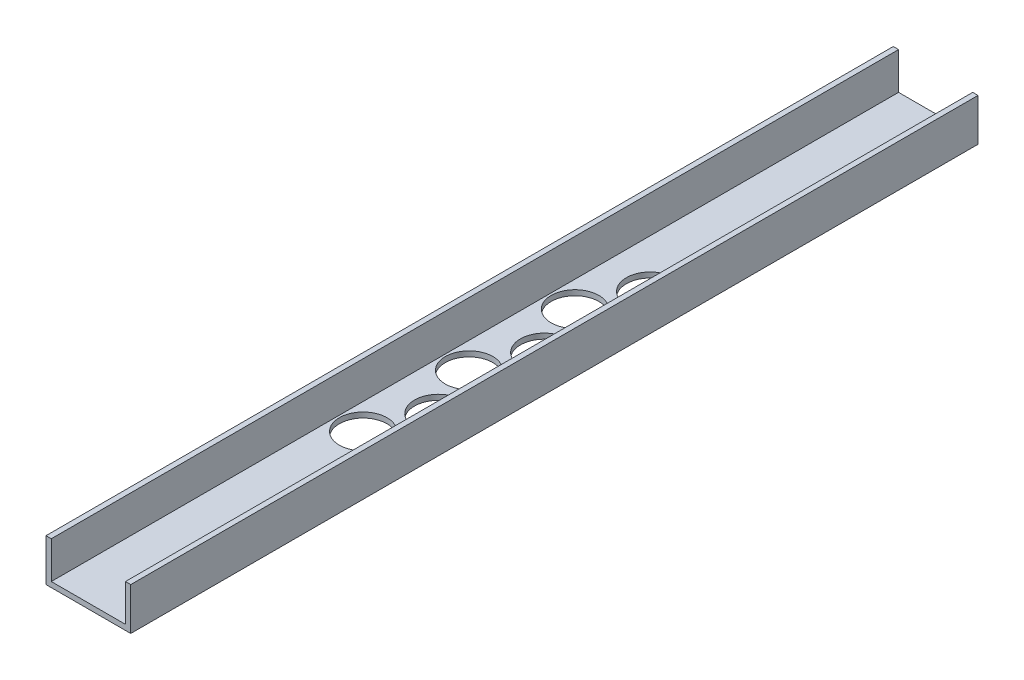
ISO-10303-21;
HEADER;
FILE_DESCRIPTION(('STEP AP214'),'2;1');
FILE_NAME('part.step','',(''),(''),'','','');
FILE_SCHEMA(('AUTOMOTIVE_DESIGN { 1 0 10303 214 1 1 1 1 }'));
ENDSEC;
DATA;
#1=APPLICATION_CONTEXT('core data for automotive mechanical design processes');
#2=APPLICATION_PROTOCOL_DEFINITION('international standard','automotive_design',2000,#1);
#3=PRODUCT_CONTEXT('',#1,'mechanical');
#4=PRODUCT('Part','Part','',(#3));
#5=PRODUCT_RELATED_PRODUCT_CATEGORY('part','',(#4));
#6=PRODUCT_DEFINITION_FORMATION('','',#4);
#7=PRODUCT_DEFINITION_CONTEXT('part definition',#1,'design');
#8=PRODUCT_DEFINITION('design','',#6,#7);
#9=PRODUCT_DEFINITION_SHAPE('','',#8);
#10=(LENGTH_UNIT() NAMED_UNIT(*) SI_UNIT(.MILLI.,.METRE.));
#11=(NAMED_UNIT(*) PLANE_ANGLE_UNIT() SI_UNIT($,.RADIAN.));
#12=(NAMED_UNIT(*) SI_UNIT($,.STERADIAN.) SOLID_ANGLE_UNIT());
#13=UNCERTAINTY_MEASURE_WITH_UNIT(LENGTH_MEASURE(1.E-05),#10,'distance_accuracy_value','');
#14=(GEOMETRIC_REPRESENTATION_CONTEXT(3) GLOBAL_UNCERTAINTY_ASSIGNED_CONTEXT((#13)) GLOBAL_UNIT_ASSIGNED_CONTEXT((#10,
#11,#12)) REPRESENTATION_CONTEXT('',''));
#15=CARTESIAN_POINT('',(0.,0.,0.));
#16=DIRECTION('',(0.,0.,1.));
#17=DIRECTION('',(1.,0.,0.));
#18=AXIS2_PLACEMENT_3D('',#15,#16,#17);
#19=CARTESIAN_POINT('',(0.,0.,508.));
#20=DIRECTION('',(1.,0.,0.));
#21=DIRECTION('',(0.,0.,-1.));
#22=AXIS2_PLACEMENT_3D('',#19,#20,#21);
#23=PLANE('',#22);
#24=DIRECTION('',(0.,-1.,0.));
#25=VECTOR('',#24,1.);
#26=CARTESIAN_POINT('',(0.,0.,0.));
#27=LINE('',#26,#25);
#28=CARTESIAN_POINT('',(0.,25.4,0.));
#29=VERTEX_POINT('',#28);
#30=CARTESIAN_POINT('',(0.,0.,0.));
#31=VERTEX_POINT('',#30);
#32=EDGE_CURVE('E133',#29,#31,#27,.T.);
#33=ORIENTED_EDGE('',*,*,#32,.T.);
#34=DIRECTION('',(0.,0.,-1.));
#35=VECTOR('',#34,1.);
#36=CARTESIAN_POINT('',(0.,0.,508.));
#37=LINE('',#36,#35);
#38=CARTESIAN_POINT('',(0.,0.,508.));
#39=VERTEX_POINT('',#38);
#40=EDGE_CURVE('E11',#39,#31,#37,.T.);
#41=ORIENTED_EDGE('',*,*,#40,.F.);
#42=DIRECTION('',(0.,-1.,0.));
#43=VECTOR('',#42,1.);
#44=CARTESIAN_POINT('',(0.,0.,508.));
#45=LINE('',#44,#43);
#46=CARTESIAN_POINT('',(0.,25.4,508.));
#47=VERTEX_POINT('',#46);
#48=EDGE_CURVE('E148',#47,#39,#45,.T.);
#49=ORIENTED_EDGE('',*,*,#48,.F.);
#50=DIRECTION('',(0.,0.,-1.));
#51=VECTOR('',#50,1.);
#52=CARTESIAN_POINT('',(0.,25.4,508.));
#53=LINE('',#52,#51);
#54=EDGE_CURVE('E129',#47,#29,#53,.T.);
#55=ORIENTED_EDGE('',*,*,#54,.T.);
#56=EDGE_LOOP('',(#33,#41,#49,#55));
#57=FACE_BOUND('',#56,.T.);
#58=ADVANCED_FACE('F37',(#57),#23,.F.);
#59=CARTESIAN_POINT('',(0.,0.,508.));
#60=DIRECTION('',(0.,1.,0.));
#61=DIRECTION('',(0.,0.,1.));
#62=AXIS2_PLACEMENT_3D('',#59,#60,#61);
#63=PLANE('',#62);
#64=CARTESIAN_POINT('',(18.7325,0.,336.55));
#65=DIRECTION('',(0.,1.,0.));
#66=DIRECTION('',(0.,0.,1.));
#67=AXIS2_PLACEMENT_3D('',#64,#65,#66);
#68=CIRCLE('',#67,14.2875);
#69=CARTESIAN_POINT('',(18.7325,0.,350.8375));
#70=VERTEX_POINT('',#69);
#71=EDGE_CURVE('E137',#70,#70,#68,.F.);
#72=ORIENTED_EDGE('',*,*,#71,.F.);
#73=EDGE_LOOP('',(#72));
#74=FACE_BOUND('',#73,.T.);
#75=CARTESIAN_POINT('',(32.0675,0.,304.8));
#76=DIRECTION('',(0.,1.,0.));
#77=DIRECTION('',(0.,0.,1.));
#78=AXIS2_PLACEMENT_3D('',#75,#76,#77);
#79=CIRCLE('',#78,14.2875);
#80=CARTESIAN_POINT('',(32.0675,0.,319.0875));
#81=VERTEX_POINT('',#80);
#82=EDGE_CURVE('E206',#81,#81,#79,.F.);
#83=ORIENTED_EDGE('',*,*,#82,.F.);
#84=EDGE_LOOP('',(#83));
#85=FACE_BOUND('',#84,.T.);
#86=CARTESIAN_POINT('',(18.7325,0.,273.05));
#87=DIRECTION('',(0.,1.,0.));
#88=DIRECTION('',(0.,0.,1.));
#89=AXIS2_PLACEMENT_3D('',#86,#87,#88);
#90=CIRCLE('',#89,14.2875);
#91=CARTESIAN_POINT('',(18.7325,0.,287.3375));
#92=VERTEX_POINT('',#91);
#93=EDGE_CURVE('E200',#92,#92,#90,.F.);
#94=ORIENTED_EDGE('',*,*,#93,.F.);
#95=EDGE_LOOP('',(#94));
#96=FACE_BOUND('',#95,.T.);
#97=CARTESIAN_POINT('',(32.0675,0.,241.3));
#98=DIRECTION('',(0.,1.,0.));
#99=DIRECTION('',(0.,0.,1.));
#100=AXIS2_PLACEMENT_3D('',#97,#98,#99);
#101=CIRCLE('',#100,14.2875);
#102=CARTESIAN_POINT('',(32.0675,0.,255.5875));
#103=VERTEX_POINT('',#102);
#104=EDGE_CURVE('E194',#103,#103,#101,.F.);
#105=ORIENTED_EDGE('',*,*,#104,.F.);
#106=EDGE_LOOP('',(#105));
#107=FACE_BOUND('',#106,.T.);
#108=CARTESIAN_POINT('',(18.7325,0.,209.55));
#109=DIRECTION('',(0.,1.,0.));
#110=DIRECTION('',(0.,0.,1.));
#111=AXIS2_PLACEMENT_3D('',#108,#109,#110);
#112=CIRCLE('',#111,14.2875);
#113=CARTESIAN_POINT('',(18.7325,0.,223.8375));
#114=VERTEX_POINT('',#113);
#115=EDGE_CURVE('E188',#114,#114,#112,.F.);
#116=ORIENTED_EDGE('',*,*,#115,.F.);
#117=EDGE_LOOP('',(#116));
#118=FACE_BOUND('',#117,.T.);
#119=CARTESIAN_POINT('',(32.0675,0.,177.8));
#120=DIRECTION('',(0.,1.,0.));
#121=DIRECTION('',(0.,0.,1.));
#122=AXIS2_PLACEMENT_3D('',#119,#120,#121);
#123=CIRCLE('',#122,14.2875);
#124=CARTESIAN_POINT('',(32.0675,0.,192.0875));
#125=VERTEX_POINT('',#124);
#126=EDGE_CURVE('E181',#125,#125,#123,.F.);
#127=ORIENTED_EDGE('',*,*,#126,.F.);
#128=EDGE_LOOP('',(#127));
#129=FACE_BOUND('',#128,.T.);
#130=DIRECTION('',(1.,0.,0.));
#131=VECTOR('',#130,1.);
#132=CARTESIAN_POINT('',(0.,0.,0.));
#133=LINE('',#132,#131);
#134=CARTESIAN_POINT('',(50.8,0.,0.));
#135=VERTEX_POINT('',#134);
#136=EDGE_CURVE('E136',#31,#135,#133,.T.);
#137=ORIENTED_EDGE('',*,*,#136,.T.);
#138=DIRECTION('',(0.,0.,-1.));
#139=VECTOR('',#138,1.);
#140=CARTESIAN_POINT('',(50.8,0.,508.));
#141=LINE('',#140,#139);
#142=CARTESIAN_POINT('',(50.8,0.,508.));
#143=VERTEX_POINT('',#142);
#144=EDGE_CURVE('E45',#143,#135,#141,.T.);
#145=ORIENTED_EDGE('',*,*,#144,.F.);
#146=DIRECTION('',(1.,0.,0.));
#147=VECTOR('',#146,1.);
#148=CARTESIAN_POINT('',(0.,0.,508.));
#149=LINE('',#148,#147);
#150=EDGE_CURVE('E96',#39,#143,#149,.T.);
#151=ORIENTED_EDGE('',*,*,#150,.F.);
#152=ORIENTED_EDGE('',*,*,#40,.T.);
#153=EDGE_LOOP('',(#137,#145,#151,#152));
#154=FACE_BOUND('',#153,.T.);
#155=ADVANCED_FACE('F240',(#74,#85,#96,#107,#118,#129,#154),#63,.F.);
#156=CARTESIAN_POINT('',(50.8,0.,508.));
#157=DIRECTION('',(-1.,0.,0.));
#158=DIRECTION('',(0.,0.,1.));
#159=AXIS2_PLACEMENT_3D('',#156,#157,#158);
#160=PLANE('',#159);
#161=DIRECTION('',(0.,1.,0.));
#162=VECTOR('',#161,1.);
#163=CARTESIAN_POINT('',(50.8,0.,0.));
#164=LINE('',#163,#162);
#165=CARTESIAN_POINT('',(50.8,25.4,0.));
#166=VERTEX_POINT('',#165);
#167=EDGE_CURVE('E139',#135,#166,#164,.T.);
#168=ORIENTED_EDGE('',*,*,#167,.T.);
#169=DIRECTION('',(0.,0.,-1.));
#170=VECTOR('',#169,1.);
#171=CARTESIAN_POINT('',(50.8,25.4,508.));
#172=LINE('',#171,#170);
#173=CARTESIAN_POINT('',(50.8,25.4,508.));
#174=VERTEX_POINT('',#173);
#175=EDGE_CURVE('E155',#174,#166,#172,.T.);
#176=ORIENTED_EDGE('',*,*,#175,.F.);
#177=DIRECTION('',(0.,1.,0.));
#178=VECTOR('',#177,1.);
#179=CARTESIAN_POINT('',(50.8,0.,508.));
#180=LINE('',#179,#178);
#181=EDGE_CURVE('E163',#143,#174,#180,.T.);
#182=ORIENTED_EDGE('',*,*,#181,.F.);
#183=ORIENTED_EDGE('',*,*,#144,.T.);
#184=EDGE_LOOP('',(#168,#176,#182,#183));
#185=FACE_BOUND('',#184,.T.);
#186=ADVANCED_FACE('F161',(#185),#160,.F.);
#187=CARTESIAN_POINT('',(50.8,25.4,508.));
#188=DIRECTION('',(0.,-1.,0.));
#189=DIRECTION('',(0.,0.,-1.));
#190=AXIS2_PLACEMENT_3D('',#187,#188,#189);
#191=PLANE('',#190);
#192=DIRECTION('',(-1.,0.,0.));
#193=VECTOR('',#192,1.);
#194=CARTESIAN_POINT('',(50.8,25.4,0.));
#195=LINE('',#194,#193);
#196=CARTESIAN_POINT('',(47.625,25.4,0.));
#197=VERTEX_POINT('',#196);
#198=EDGE_CURVE('E141',#166,#197,#195,.T.);
#199=ORIENTED_EDGE('',*,*,#198,.T.);
#200=DIRECTION('',(0.,0.,-1.));
#201=VECTOR('',#200,1.);
#202=CARTESIAN_POINT('',(47.625,25.4,508.));
#203=LINE('',#202,#201);
#204=CARTESIAN_POINT('',(47.625,25.4,508.));
#205=VERTEX_POINT('',#204);
#206=EDGE_CURVE('E152',#205,#197,#203,.T.);
#207=ORIENTED_EDGE('',*,*,#206,.F.);
#208=DIRECTION('',(-1.,0.,0.));
#209=VECTOR('',#208,1.);
#210=CARTESIAN_POINT('',(50.8,25.4,508.));
#211=LINE('',#210,#209);
#212=EDGE_CURVE('E175',#174,#205,#211,.T.);
#213=ORIENTED_EDGE('',*,*,#212,.F.);
#214=ORIENTED_EDGE('',*,*,#175,.T.);
#215=EDGE_LOOP('',(#199,#207,#213,#214));
#216=FACE_BOUND('',#215,.T.);
#217=ADVANCED_FACE('F171',(#216),#191,.F.);
#218=CARTESIAN_POINT('',(47.625,3.175,508.));
#219=DIRECTION('',(1.,0.,0.));
#220=DIRECTION('',(0.,0.,-1.));
#221=AXIS2_PLACEMENT_3D('',#218,#219,#220);
#222=PLANE('',#221);
#223=DIRECTION('',(0.,-1.,0.));
#224=VECTOR('',#223,1.);
#225=CARTESIAN_POINT('',(47.625,3.175,0.));
#226=LINE('',#225,#224);
#227=CARTESIAN_POINT('',(47.625,3.175,0.));
#228=VERTEX_POINT('',#227);
#229=EDGE_CURVE('E143',#197,#228,#226,.T.);
#230=ORIENTED_EDGE('',*,*,#229,.T.);
#231=DIRECTION('',(0.,0.,-1.));
#232=VECTOR('',#231,1.);
#233=CARTESIAN_POINT('',(47.625,3.175,508.));
#234=LINE('',#233,#232);
#235=CARTESIAN_POINT('',(47.625,3.175,508.));
#236=VERTEX_POINT('',#235);
#237=EDGE_CURVE('E124',#236,#228,#234,.T.);
#238=ORIENTED_EDGE('',*,*,#237,.F.);
#239=DIRECTION('',(0.,-1.,0.));
#240=VECTOR('',#239,1.);
#241=CARTESIAN_POINT('',(47.625,3.175,508.));
#242=LINE('',#241,#240);
#243=EDGE_CURVE('E115',#205,#236,#242,.T.);
#244=ORIENTED_EDGE('',*,*,#243,.F.);
#245=ORIENTED_EDGE('',*,*,#206,.T.);
#246=EDGE_LOOP('',(#230,#238,#244,#245));
#247=FACE_BOUND('',#246,.T.);
#248=ADVANCED_FACE('F174',(#247),#222,.F.);
#249=CARTESIAN_POINT('',(3.175,3.175,508.));
#250=DIRECTION('',(0.,-1.,0.));
#251=DIRECTION('',(0.,0.,-1.));
#252=AXIS2_PLACEMENT_3D('',#249,#250,#251);
#253=PLANE('',#252);
#254=CARTESIAN_POINT('',(18.7325,3.175,336.55));
#255=DIRECTION('',(0.,1.,0.));
#256=DIRECTION('',(0.,0.,1.));
#257=AXIS2_PLACEMENT_3D('',#254,#255,#256);
#258=CIRCLE('',#257,14.2875);
#259=CARTESIAN_POINT('',(18.7325,3.175,350.8375));
#260=VERTEX_POINT('',#259);
#261=EDGE_CURVE('E209',#260,#260,#258,.T.);
#262=ORIENTED_EDGE('',*,*,#261,.F.);
#263=EDGE_LOOP('',(#262));
#264=FACE_BOUND('',#263,.T.);
#265=CARTESIAN_POINT('',(32.0675,3.175,304.8));
#266=DIRECTION('',(0.,1.,0.));
#267=DIRECTION('',(0.,0.,1.));
#268=AXIS2_PLACEMENT_3D('',#265,#266,#267);
#269=CIRCLE('',#268,14.2875);
#270=CARTESIAN_POINT('',(32.0675,3.175,319.0875));
#271=VERTEX_POINT('',#270);
#272=EDGE_CURVE('E203',#271,#271,#269,.T.);
#273=ORIENTED_EDGE('',*,*,#272,.F.);
#274=EDGE_LOOP('',(#273));
#275=FACE_BOUND('',#274,.T.);
#276=CARTESIAN_POINT('',(18.7325,3.175,273.05));
#277=DIRECTION('',(0.,1.,0.));
#278=DIRECTION('',(0.,0.,1.));
#279=AXIS2_PLACEMENT_3D('',#276,#277,#278);
#280=CIRCLE('',#279,14.2875);
#281=CARTESIAN_POINT('',(18.7325,3.175,287.3375));
#282=VERTEX_POINT('',#281);
#283=EDGE_CURVE('E197',#282,#282,#280,.T.);
#284=ORIENTED_EDGE('',*,*,#283,.F.);
#285=EDGE_LOOP('',(#284));
#286=FACE_BOUND('',#285,.T.);
#287=CARTESIAN_POINT('',(32.0675,3.175,241.3));
#288=DIRECTION('',(0.,1.,0.));
#289=DIRECTION('',(0.,0.,1.));
#290=AXIS2_PLACEMENT_3D('',#287,#288,#289);
#291=CIRCLE('',#290,14.2875);
#292=CARTESIAN_POINT('',(32.0675,3.175,255.5875));
#293=VERTEX_POINT('',#292);
#294=EDGE_CURVE('E191',#293,#293,#291,.T.);
#295=ORIENTED_EDGE('',*,*,#294,.F.);
#296=EDGE_LOOP('',(#295));
#297=FACE_BOUND('',#296,.T.);
#298=CARTESIAN_POINT('',(18.7325,3.175,209.55));
#299=DIRECTION('',(0.,1.,0.));
#300=DIRECTION('',(0.,0.,1.));
#301=AXIS2_PLACEMENT_3D('',#298,#299,#300);
#302=CIRCLE('',#301,14.2875);
#303=CARTESIAN_POINT('',(18.7325,3.175,223.8375));
#304=VERTEX_POINT('',#303);
#305=EDGE_CURVE('E184',#304,#304,#302,.T.);
#306=ORIENTED_EDGE('',*,*,#305,.F.);
#307=EDGE_LOOP('',(#306));
#308=FACE_BOUND('',#307,.T.);
#309=CARTESIAN_POINT('',(32.0675,3.175,177.8));
#310=DIRECTION('',(0.,1.,0.));
#311=DIRECTION('',(0.,0.,1.));
#312=AXIS2_PLACEMENT_3D('',#309,#310,#311);
#313=CIRCLE('',#312,14.2875);
#314=CARTESIAN_POINT('',(32.0675,3.175,192.0875));
#315=VERTEX_POINT('',#314);
#316=EDGE_CURVE('E185',#315,#315,#313,.T.);
#317=ORIENTED_EDGE('',*,*,#316,.F.);
#318=EDGE_LOOP('',(#317));
#319=FACE_BOUND('',#318,.T.);
#320=DIRECTION('',(-1.,0.,0.));
#321=VECTOR('',#320,1.);
#322=CARTESIAN_POINT('',(3.175,3.175,0.));
#323=LINE('',#322,#321);
#324=CARTESIAN_POINT('',(3.175,3.175,0.));
#325=VERTEX_POINT('',#324);
#326=EDGE_CURVE('E123',#228,#325,#323,.T.);
#327=ORIENTED_EDGE('',*,*,#326,.T.);
#328=DIRECTION('',(0.,0.,-1.));
#329=VECTOR('',#328,1.);
#330=CARTESIAN_POINT('',(3.175,3.175,508.));
#331=LINE('',#330,#329);
#332=CARTESIAN_POINT('',(3.175,3.175,508.));
#333=VERTEX_POINT('',#332);
#334=EDGE_CURVE('E120',#333,#325,#331,.T.);
#335=ORIENTED_EDGE('',*,*,#334,.F.);
#336=DIRECTION('',(-1.,0.,0.));
#337=VECTOR('',#336,1.);
#338=CARTESIAN_POINT('',(3.175,3.175,508.));
#339=LINE('',#338,#337);
#340=EDGE_CURVE('E109',#236,#333,#339,.T.);
#341=ORIENTED_EDGE('',*,*,#340,.F.);
#342=ORIENTED_EDGE('',*,*,#237,.T.);
#343=EDGE_LOOP('',(#327,#335,#341,#342));
#344=FACE_BOUND('',#343,.T.);
#345=ADVANCED_FACE('F121',(#264,#275,#286,#297,#308,#319,#344),#253,.F.);
#346=CARTESIAN_POINT('',(3.175,3.175,508.));
#347=DIRECTION('',(-1.,0.,0.));
#348=DIRECTION('',(0.,0.,1.));
#349=AXIS2_PLACEMENT_3D('',#346,#347,#348);
#350=PLANE('',#349);
#351=DIRECTION('',(0.,1.,0.));
#352=VECTOR('',#351,1.);
#353=CARTESIAN_POINT('',(3.175,3.175,0.));
#354=LINE('',#353,#352);
#355=CARTESIAN_POINT('',(3.175,25.4,0.));
#356=VERTEX_POINT('',#355);
#357=EDGE_CURVE('E82',#325,#356,#354,.T.);
#358=ORIENTED_EDGE('',*,*,#357,.T.);
#359=DIRECTION('',(0.,0.,-1.));
#360=VECTOR('',#359,1.);
#361=CARTESIAN_POINT('',(3.175,25.4,508.));
#362=LINE('',#361,#360);
#363=CARTESIAN_POINT('',(3.175,25.4,508.));
#364=VERTEX_POINT('',#363);
#365=EDGE_CURVE('E125',#364,#356,#362,.T.);
#366=ORIENTED_EDGE('',*,*,#365,.F.);
#367=DIRECTION('',(0.,1.,0.));
#368=VECTOR('',#367,1.);
#369=CARTESIAN_POINT('',(3.175,3.175,508.));
#370=LINE('',#369,#368);
#371=EDGE_CURVE('E113',#333,#364,#370,.T.);
#372=ORIENTED_EDGE('',*,*,#371,.F.);
#373=ORIENTED_EDGE('',*,*,#334,.T.);
#374=EDGE_LOOP('',(#358,#366,#372,#373));
#375=FACE_BOUND('',#374,.T.);
#376=ADVANCED_FACE('F127',(#375),#350,.F.);
#377=CARTESIAN_POINT('',(0.,25.4,508.));
#378=DIRECTION('',(0.,-1.,0.));
#379=DIRECTION('',(0.,0.,-1.));
#380=AXIS2_PLACEMENT_3D('',#377,#378,#379);
#381=PLANE('',#380);
#382=DIRECTION('',(-1.,0.,0.));
#383=VECTOR('',#382,1.);
#384=CARTESIAN_POINT('',(0.,25.4,0.));
#385=LINE('',#384,#383);
#386=EDGE_CURVE('E88',#356,#29,#385,.T.);
#387=ORIENTED_EDGE('',*,*,#386,.T.);
#388=ORIENTED_EDGE('',*,*,#54,.F.);
#389=DIRECTION('',(-1.,0.,0.));
#390=VECTOR('',#389,1.);
#391=CARTESIAN_POINT('',(0.,25.4,508.));
#392=LINE('',#391,#390);
#393=EDGE_CURVE('E53',#364,#47,#392,.T.);
#394=ORIENTED_EDGE('',*,*,#393,.F.);
#395=ORIENTED_EDGE('',*,*,#365,.T.);
#396=EDGE_LOOP('',(#387,#388,#394,#395));
#397=FACE_BOUND('',#396,.T.);
#398=ADVANCED_FACE('F246',(#397),#381,.F.);
#399=CARTESIAN_POINT('',(0.,0.,508.));
#400=DIRECTION('',(0.,0.,-1.));
#401=DIRECTION('',(-1.,0.,0.));
#402=AXIS2_PLACEMENT_3D('',#399,#400,#401);
#403=PLANE('',#402);
#404=ORIENTED_EDGE('',*,*,#48,.T.);
#405=ORIENTED_EDGE('',*,*,#150,.T.);
#406=ORIENTED_EDGE('',*,*,#181,.T.);
#407=ORIENTED_EDGE('',*,*,#212,.T.);
#408=ORIENTED_EDGE('',*,*,#243,.T.);
#409=ORIENTED_EDGE('',*,*,#340,.T.);
#410=ORIENTED_EDGE('',*,*,#371,.T.);
#411=ORIENTED_EDGE('',*,*,#393,.T.);
#412=EDGE_LOOP('',(#404,#405,#406,#407,#408,#409,#410,#411));
#413=FACE_BOUND('',#412,.T.);
#414=ADVANCED_FACE('F111',(#413),#403,.F.);
#415=CARTESIAN_POINT('',(0.,0.,0.));
#416=DIRECTION('',(0.,0.,-1.));
#417=DIRECTION('',(-1.,0.,0.));
#418=AXIS2_PLACEMENT_3D('',#415,#416,#417);
#419=PLANE('',#418);
#420=ORIENTED_EDGE('',*,*,#32,.F.);
#421=ORIENTED_EDGE('',*,*,#386,.F.);
#422=ORIENTED_EDGE('',*,*,#357,.F.);
#423=ORIENTED_EDGE('',*,*,#326,.F.);
#424=ORIENTED_EDGE('',*,*,#229,.F.);
#425=ORIENTED_EDGE('',*,*,#198,.F.);
#426=ORIENTED_EDGE('',*,*,#167,.F.);
#427=ORIENTED_EDGE('',*,*,#136,.F.);
#428=EDGE_LOOP('',(#420,#421,#422,#423,#424,#425,#426,#427));
#429=FACE_BOUND('',#428,.T.);
#430=ADVANCED_FACE('F167',(#429),#419,.T.);
#431=CARTESIAN_POINT('',(32.0675,-0.00100000000000013,177.8));
#432=DIRECTION('',(0.,1.,0.));
#433=DIRECTION('',(0.,0.,1.));
#434=AXIS2_PLACEMENT_3D('',#431,#432,#433);
#435=CYLINDRICAL_SURFACE('',#434,14.2875);
#436=ORIENTED_EDGE('',*,*,#316,.T.);
#437=EDGE_LOOP('',(#436));
#438=FACE_BOUND('',#437,.T.);
#439=ORIENTED_EDGE('',*,*,#126,.T.);
#440=EDGE_LOOP('',(#439));
#441=FACE_BOUND('',#440,.T.);
#442=ADVANCED_FACE('F233',(#438,#441),#435,.F.);
#443=CARTESIAN_POINT('',(18.7325,-0.00100000000000013,209.55));
#444=DIRECTION('',(0.,1.,0.));
#445=DIRECTION('',(0.,0.,1.));
#446=AXIS2_PLACEMENT_3D('',#443,#444,#445);
#447=CYLINDRICAL_SURFACE('',#446,14.2875);
#448=ORIENTED_EDGE('',*,*,#305,.T.);
#449=EDGE_LOOP('',(#448));
#450=FACE_BOUND('',#449,.T.);
#451=ORIENTED_EDGE('',*,*,#115,.T.);
#452=EDGE_LOOP('',(#451));
#453=FACE_BOUND('',#452,.T.);
#454=ADVANCED_FACE('F236',(#450,#453),#447,.F.);
#455=CARTESIAN_POINT('',(32.0675,-0.00100000000000013,241.3));
#456=DIRECTION('',(0.,1.,0.));
#457=DIRECTION('',(0.,0.,1.));
#458=AXIS2_PLACEMENT_3D('',#455,#456,#457);
#459=CYLINDRICAL_SURFACE('',#458,14.2875);
#460=ORIENTED_EDGE('',*,*,#294,.T.);
#461=EDGE_LOOP('',(#460));
#462=FACE_BOUND('',#461,.T.);
#463=ORIENTED_EDGE('',*,*,#104,.T.);
#464=EDGE_LOOP('',(#463));
#465=FACE_BOUND('',#464,.T.);
#466=ADVANCED_FACE('F322',(#462,#465),#459,.F.);
#467=CARTESIAN_POINT('',(18.7325,-0.00100000000000013,273.05));
#468=DIRECTION('',(0.,1.,0.));
#469=DIRECTION('',(0.,0.,1.));
#470=AXIS2_PLACEMENT_3D('',#467,#468,#469);
#471=CYLINDRICAL_SURFACE('',#470,14.2875);
#472=ORIENTED_EDGE('',*,*,#283,.T.);
#473=EDGE_LOOP('',(#472));
#474=FACE_BOUND('',#473,.T.);
#475=ORIENTED_EDGE('',*,*,#93,.T.);
#476=EDGE_LOOP('',(#475));
#477=FACE_BOUND('',#476,.T.);
#478=ADVANCED_FACE('F330',(#474,#477),#471,.F.);
#479=CARTESIAN_POINT('',(32.0675,-0.00100000000000013,304.8));
#480=DIRECTION('',(0.,1.,0.));
#481=DIRECTION('',(0.,0.,1.));
#482=AXIS2_PLACEMENT_3D('',#479,#480,#481);
#483=CYLINDRICAL_SURFACE('',#482,14.2875);
#484=ORIENTED_EDGE('',*,*,#272,.T.);
#485=EDGE_LOOP('',(#484));
#486=FACE_BOUND('',#485,.T.);
#487=ORIENTED_EDGE('',*,*,#82,.T.);
#488=EDGE_LOOP('',(#487));
#489=FACE_BOUND('',#488,.T.);
#490=ADVANCED_FACE('F338',(#486,#489),#483,.F.);
#491=CARTESIAN_POINT('',(18.7325,-0.00100000000000013,336.55));
#492=DIRECTION('',(0.,1.,0.));
#493=DIRECTION('',(0.,0.,1.));
#494=AXIS2_PLACEMENT_3D('',#491,#492,#493);
#495=CYLINDRICAL_SURFACE('',#494,14.2875);
#496=ORIENTED_EDGE('',*,*,#261,.T.);
#497=EDGE_LOOP('',(#496));
#498=FACE_BOUND('',#497,.T.);
#499=ORIENTED_EDGE('',*,*,#71,.T.);
#500=EDGE_LOOP('',(#499));
#501=FACE_BOUND('',#500,.T.);
#502=ADVANCED_FACE('F217',(#498,#501),#495,.F.);
#503=CLOSED_SHELL('',(#58,#155,#186,#217,#248,#345,#376,#398,#414,#430,#442,#454,#466,#478,#490,#502));
#504=MANIFOLD_SOLID_BREP('B2',#503);
#505=ADVANCED_BREP_SHAPE_REPRESENTATION('',(#18,#504),#14);
#506=SHAPE_DEFINITION_REPRESENTATION(#9,#505);
ENDSEC;
END-ISO-10303-21;
